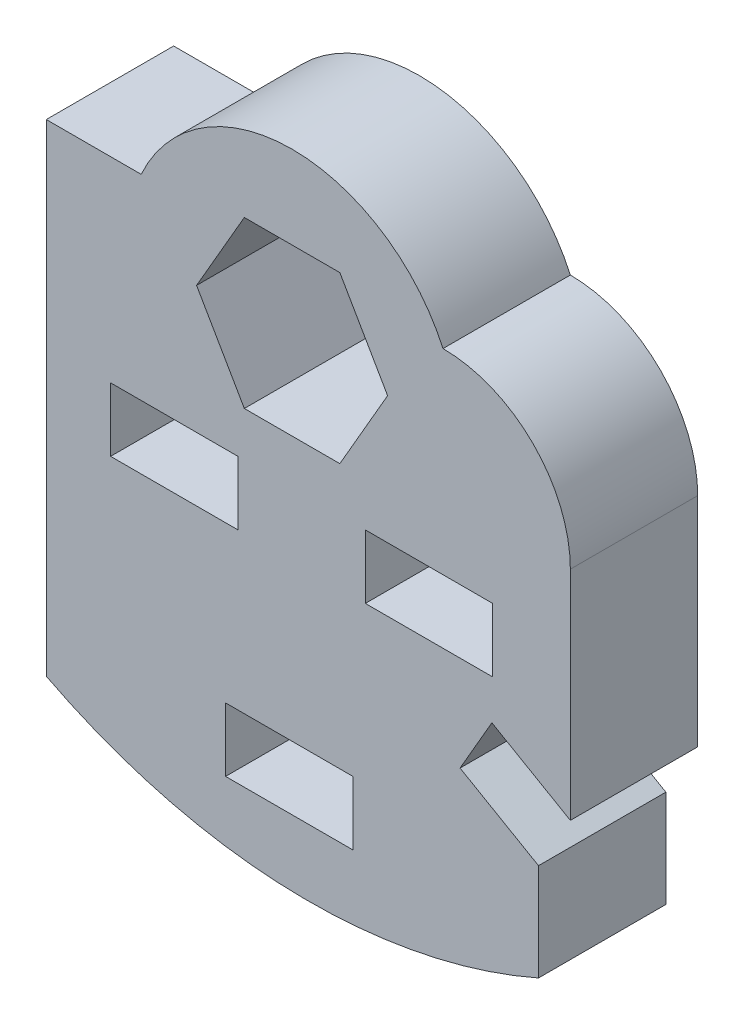
ISO-10303-21;
HEADER;
FILE_DESCRIPTION(('STEP AP214'),'2;1');
FILE_NAME('part.step','',(''),(''),'','','');
FILE_SCHEMA(('AUTOMOTIVE_DESIGN { 1 0 10303 214 1 1 1 1 }'));
ENDSEC;
DATA;
#1=APPLICATION_CONTEXT('core data for automotive mechanical design processes');
#2=APPLICATION_PROTOCOL_DEFINITION('international standard','automotive_design',2000,#1);
#3=PRODUCT_CONTEXT('',#1,'mechanical');
#4=PRODUCT('Part','Part','',(#3));
#5=PRODUCT_RELATED_PRODUCT_CATEGORY('part','',(#4));
#6=PRODUCT_DEFINITION_FORMATION('','',#4);
#7=PRODUCT_DEFINITION_CONTEXT('part definition',#1,'design');
#8=PRODUCT_DEFINITION('design','',#6,#7);
#9=PRODUCT_DEFINITION_SHAPE('','',#8);
#10=(LENGTH_UNIT() NAMED_UNIT(*) SI_UNIT(.MILLI.,.METRE.));
#11=(NAMED_UNIT(*) PLANE_ANGLE_UNIT() SI_UNIT($,.RADIAN.));
#12=(NAMED_UNIT(*) SI_UNIT($,.STERADIAN.) SOLID_ANGLE_UNIT());
#13=UNCERTAINTY_MEASURE_WITH_UNIT(LENGTH_MEASURE(1.E-05),#10,'distance_accuracy_value','');
#14=(GEOMETRIC_REPRESENTATION_CONTEXT(3) GLOBAL_UNCERTAINTY_ASSIGNED_CONTEXT((#13)) GLOBAL_UNIT_ASSIGNED_CONTEXT((#10,
#11,#12)) REPRESENTATION_CONTEXT('',''));
#15=CARTESIAN_POINT('',(0.,0.,0.));
#16=DIRECTION('',(0.,0.,1.));
#17=DIRECTION('',(1.,0.,0.));
#18=AXIS2_PLACEMENT_3D('',#15,#16,#17);
#19=CARTESIAN_POINT('',(13.9396736813884,13.1425512647541,4.));
#20=DIRECTION('',(0.,0.,1.));
#21=DIRECTION('',(1.,0.,0.));
#22=AXIS2_PLACEMENT_3D('',#19,#20,#21);
#23=PLANE('',#22);
#24=DIRECTION('',(0.,-1.,0.));
#25=VECTOR('',#24,1.);
#26=CARTESIAN_POINT('',(11.5,8.99107807997269,4.));
#27=LINE('',#26,#25);
#28=CARTESIAN_POINT('',(11.5,10.9910780799727,4.));
#29=VERTEX_POINT('',#28);
#30=CARTESIAN_POINT('',(11.5,8.99107807997269,4.));
#31=VERTEX_POINT('',#30);
#32=EDGE_CURVE('E270',#29,#31,#27,.T.);
#33=ORIENTED_EDGE('',*,*,#32,.F.);
#34=DIRECTION('',(-1.,0.,0.));
#35=VECTOR('',#34,1.);
#36=CARTESIAN_POINT('',(11.5,10.9910780799727,4.));
#37=LINE('',#36,#35);
#38=CARTESIAN_POINT('',(15.5,10.9910780799727,4.));
#39=VERTEX_POINT('',#38);
#40=EDGE_CURVE('E268',#39,#29,#37,.T.);
#41=ORIENTED_EDGE('',*,*,#40,.F.);
#42=DIRECTION('',(0.,1.,0.));
#43=VECTOR('',#42,1.);
#44=CARTESIAN_POINT('',(15.5,8.99107807997269,4.));
#45=LINE('',#44,#43);
#46=CARTESIAN_POINT('',(15.5,8.99107807997269,4.));
#47=VERTEX_POINT('',#46);
#48=EDGE_CURVE('E276',#47,#39,#45,.T.);
#49=ORIENTED_EDGE('',*,*,#48,.F.);
#50=DIRECTION('',(1.,0.,0.));
#51=VECTOR('',#50,1.);
#52=CARTESIAN_POINT('',(11.5,8.99107807997269,4.));
#53=LINE('',#52,#51);
#54=EDGE_CURVE('E273',#31,#47,#53,.T.);
#55=ORIENTED_EDGE('',*,*,#54,.F.);
#56=EDGE_LOOP('',(#33,#41,#49,#55));
#57=FACE_BOUND('',#56,.T.);
#58=DIRECTION('',(0.,-1.,0.));
#59=VECTOR('',#58,1.);
#60=CARTESIAN_POINT('',(7.11105611722977,2.0910780799727,4.));
#61=LINE('',#60,#59);
#62=CARTESIAN_POINT('',(7.11105611722977,4.0910780799727,4.));
#63=VERTEX_POINT('',#62);
#64=CARTESIAN_POINT('',(7.11105611722977,2.0910780799727,4.));
#65=VERTEX_POINT('',#64);
#66=EDGE_CURVE('E332',#63,#65,#61,.T.);
#67=ORIENTED_EDGE('',*,*,#66,.F.);
#68=DIRECTION('',(-1.,0.,0.));
#69=VECTOR('',#68,1.);
#70=CARTESIAN_POINT('',(7.11105611722977,4.0910780799727,4.));
#71=LINE('',#70,#69);
#72=CARTESIAN_POINT('',(11.1110561172298,4.0910780799727,4.));
#73=VERTEX_POINT('',#72);
#74=EDGE_CURVE('E330',#73,#63,#71,.T.);
#75=ORIENTED_EDGE('',*,*,#74,.F.);
#76=DIRECTION('',(0.,1.,0.));
#77=VECTOR('',#76,1.);
#78=CARTESIAN_POINT('',(11.1110561172298,2.0910780799727,4.));
#79=LINE('',#78,#77);
#80=CARTESIAN_POINT('',(11.1110561172298,2.0910780799727,4.));
#81=VERTEX_POINT('',#80);
#82=EDGE_CURVE('E338',#81,#73,#79,.T.);
#83=ORIENTED_EDGE('',*,*,#82,.F.);
#84=DIRECTION('',(1.,0.,0.));
#85=VECTOR('',#84,1.);
#86=CARTESIAN_POINT('',(7.11105611722977,2.0910780799727,4.));
#87=LINE('',#86,#85);
#88=EDGE_CURVE('E335',#65,#81,#87,.T.);
#89=ORIENTED_EDGE('',*,*,#88,.F.);
#90=EDGE_LOOP('',(#67,#75,#83,#89));
#91=FACE_BOUND('',#90,.T.);
#92=CARTESIAN_POINT('',(13.9396736813884,13.1425512647541,4.));
#93=DIRECTION('',(0.,0.,1.));
#94=DIRECTION('',(1.,0.,0.));
#95=AXIS2_PLACEMENT_3D('',#92,#93,#94);
#96=CIRCLE('',#95,4.);
#97=CARTESIAN_POINT('',(17.9396736813884,13.142551264754,4.));
#98=VERTEX_POINT('',#97);
#99=CARTESIAN_POINT('',(13.9396736813883,17.1425512647541,4.));
#100=VERTEX_POINT('',#99);
#101=EDGE_CURVE('E361',#98,#100,#96,.T.);
#102=ORIENTED_EDGE('',*,*,#101,.T.);
#103=CARTESIAN_POINT('',(9.20000000000002,14.992551264754,4.));
#104=DIRECTION('',(0.,0.,1.));
#105=DIRECTION('',(1.,0.,0.));
#106=AXIS2_PLACEMENT_3D('',#103,#104,#105);
#107=CIRCLE('',#106,5.20451790332642);
#108=CARTESIAN_POINT('',(4.46032631861171,17.1425512647541,4.));
#109=VERTEX_POINT('',#108);
#110=EDGE_CURVE('E364',#100,#109,#107,.T.);
#111=ORIENTED_EDGE('',*,*,#110,.T.);
#112=DIRECTION('',(-1.,0.,0.));
#113=VECTOR('',#112,1.);
#114=CARTESIAN_POINT('',(4.46032631861171,17.1425512647541,4.));
#115=LINE('',#114,#113);
#116=CARTESIAN_POINT('',(1.48,17.1425512647541,4.));
#117=VERTEX_POINT('',#116);
#118=EDGE_CURVE('E367',#109,#117,#115,.T.);
#119=ORIENTED_EDGE('',*,*,#118,.T.);
#120=DIRECTION('',(0.,-1.,0.));
#121=VECTOR('',#120,1.);
#122=CARTESIAN_POINT('',(1.48,17.1425512647541,4.));
#123=LINE('',#122,#121);
#124=CARTESIAN_POINT('',(1.47999999999999,2.,4.));
#125=VERTEX_POINT('',#124);
#126=EDGE_CURVE('E369',#117,#125,#123,.T.);
#127=ORIENTED_EDGE('',*,*,#126,.T.);
#128=CARTESIAN_POINT('',(9.70983684069418,17.9325536061118,4.));
#129=DIRECTION('',(0.,0.,1.));
#130=DIRECTION('',(1.,0.,0.));
#131=AXIS2_PLACEMENT_3D('',#128,#129,#130);
#132=CIRCLE('',#131,17.9325536061118);
#133=CARTESIAN_POINT('',(16.9396736813884,1.52201010222338,4.));
#134=VERTEX_POINT('',#133);
#135=EDGE_CURVE('E371',#125,#134,#132,.T.);
#136=ORIENTED_EDGE('',*,*,#135,.T.);
#137=DIRECTION('',(0.,1.,0.));
#138=VECTOR('',#137,1.);
#139=CARTESIAN_POINT('',(16.9396736813884,4.57735026918963,4.));
#140=LINE('',#139,#138);
#141=CARTESIAN_POINT('',(16.9396736813884,4.57735026918963,4.));
#142=VERTEX_POINT('',#141);
#143=EDGE_CURVE('E373',#134,#142,#140,.T.);
#144=ORIENTED_EDGE('',*,*,#143,.T.);
#145=DIRECTION('',(-0.866025403784438,0.5,0.));
#146=VECTOR('',#145,1.);
#147=CARTESIAN_POINT('',(14.4755720662506,6.,4.));
#148=LINE('',#147,#146);
#149=CARTESIAN_POINT('',(14.4755720662506,6.,4.));
#150=VERTEX_POINT('',#149);
#151=EDGE_CURVE('E375',#142,#150,#148,.T.);
#152=ORIENTED_EDGE('',*,*,#151,.T.);
#153=DIRECTION('',(0.500000000000005,0.866025403784436,0.));
#154=VECTOR('',#153,1.);
#155=CARTESIAN_POINT('',(14.4755720662506,6.,4.));
#156=LINE('',#155,#154);
#157=CARTESIAN_POINT('',(15.4755720662506,7.73205080756889,4.));
#158=VERTEX_POINT('',#157);
#159=EDGE_CURVE('E377',#150,#158,#156,.T.);
#160=ORIENTED_EDGE('',*,*,#159,.T.);
#161=DIRECTION('',(0.866025403784436,-0.500000000000005,0.));
#162=VECTOR('',#161,1.);
#163=CARTESIAN_POINT('',(15.4755720662506,7.73205080756889,4.));
#164=LINE('',#163,#162);
#165=CARTESIAN_POINT('',(17.9396736813884,6.30940107675851,4.));
#166=VERTEX_POINT('',#165);
#167=EDGE_CURVE('E379',#158,#166,#164,.T.);
#168=ORIENTED_EDGE('',*,*,#167,.T.);
#169=DIRECTION('',(0.,1.,0.));
#170=VECTOR('',#169,1.);
#171=CARTESIAN_POINT('',(17.9396736813884,13.142551264754,4.));
#172=LINE('',#171,#170);
#173=EDGE_CURVE('E381',#166,#98,#172,.T.);
#174=ORIENTED_EDGE('',*,*,#173,.T.);
#175=EDGE_LOOP('',(#102,#111,#119,#127,#136,#144,#152,#160,#168,#174));
#176=FACE_BOUND('',#175,.T.);
#177=DIRECTION('',(0.,-1.,0.));
#178=VECTOR('',#177,1.);
#179=CARTESIAN_POINT('',(3.5,8.99107807997269,4.));
#180=LINE('',#179,#178);
#181=CARTESIAN_POINT('',(3.5,10.9910780799727,4.));
#182=VERTEX_POINT('',#181);
#183=CARTESIAN_POINT('',(3.5,8.99107807997269,4.));
#184=VERTEX_POINT('',#183);
#185=EDGE_CURVE('E301',#182,#184,#180,.T.);
#186=ORIENTED_EDGE('',*,*,#185,.F.);
#187=DIRECTION('',(-1.,0.,0.));
#188=VECTOR('',#187,1.);
#189=CARTESIAN_POINT('',(3.5,10.9910780799727,4.));
#190=LINE('',#189,#188);
#191=CARTESIAN_POINT('',(7.5,10.9910780799727,4.));
#192=VERTEX_POINT('',#191);
#193=EDGE_CURVE('E299',#192,#182,#190,.T.);
#194=ORIENTED_EDGE('',*,*,#193,.F.);
#195=DIRECTION('',(0.,1.,0.));
#196=VECTOR('',#195,1.);
#197=CARTESIAN_POINT('',(7.5,8.99107807997269,4.));
#198=LINE('',#197,#196);
#199=CARTESIAN_POINT('',(7.5,8.99107807997269,4.));
#200=VERTEX_POINT('',#199);
#201=EDGE_CURVE('E307',#200,#192,#198,.T.);
#202=ORIENTED_EDGE('',*,*,#201,.F.);
#203=DIRECTION('',(1.,0.,0.));
#204=VECTOR('',#203,1.);
#205=CARTESIAN_POINT('',(3.5,8.99107807997269,4.));
#206=LINE('',#205,#204);
#207=EDGE_CURVE('E304',#184,#200,#206,.T.);
#208=ORIENTED_EDGE('',*,*,#207,.F.);
#209=EDGE_LOOP('',(#186,#194,#202,#208));
#210=FACE_BOUND('',#209,.T.);
#211=DIRECTION('',(0.500000000000001,-0.866025403784438,0.));
#212=VECTOR('',#211,1.);
#213=CARTESIAN_POINT('',(6.20000000000001,14.9910780799727,4.));
#214=LINE('',#213,#212);
#215=CARTESIAN_POINT('',(6.20000000000001,14.9910780799727,4.));
#216=VERTEX_POINT('',#215);
#217=CARTESIAN_POINT('',(7.70000000000002,12.3930018686194,4.));
#218=VERTEX_POINT('',#217);
#219=EDGE_CURVE('E225',#216,#218,#214,.T.);
#220=ORIENTED_EDGE('',*,*,#219,.F.);
#221=DIRECTION('',(-0.499999999999995,-0.866025403784442,0.));
#222=VECTOR('',#221,1.);
#223=CARTESIAN_POINT('',(7.69999999999998,17.589154291326,4.));
#224=LINE('',#223,#222);
#225=CARTESIAN_POINT('',(7.69999999999998,17.589154291326,4.));
#226=VERTEX_POINT('',#225);
#227=EDGE_CURVE('E217',#226,#216,#224,.T.);
#228=ORIENTED_EDGE('',*,*,#227,.F.);
#229=DIRECTION('',(-1.,0.,0.));
#230=VECTOR('',#229,1.);
#231=CARTESIAN_POINT('',(10.7,17.589154291326,4.));
#232=LINE('',#231,#230);
#233=CARTESIAN_POINT('',(10.7,17.589154291326,4.));
#234=VERTEX_POINT('',#233);
#235=EDGE_CURVE('E246',#234,#226,#232,.T.);
#236=ORIENTED_EDGE('',*,*,#235,.F.);
#237=DIRECTION('',(-0.500000000000007,0.866025403784435,0.));
#238=VECTOR('',#237,1.);
#239=CARTESIAN_POINT('',(12.2,14.9910780799727,4.));
#240=LINE('',#239,#238);
#241=CARTESIAN_POINT('',(12.2,14.9910780799727,4.));
#242=VERTEX_POINT('',#241);
#243=EDGE_CURVE('E244',#242,#234,#240,.T.);
#244=ORIENTED_EDGE('',*,*,#243,.F.);
#245=DIRECTION('',(0.499999999999995,0.866025403784442,0.));
#246=VECTOR('',#245,1.);
#247=CARTESIAN_POINT('',(10.7,12.3930018686194,4.));
#248=LINE('',#247,#246);
#249=CARTESIAN_POINT('',(10.7,12.3930018686194,4.));
#250=VERTEX_POINT('',#249);
#251=EDGE_CURVE('E240',#250,#242,#248,.T.);
#252=ORIENTED_EDGE('',*,*,#251,.F.);
#253=DIRECTION('',(1.,0.,0.));
#254=VECTOR('',#253,1.);
#255=CARTESIAN_POINT('',(7.70000000000002,12.3930018686194,4.));
#256=LINE('',#255,#254);
#257=EDGE_CURVE('E238',#218,#250,#256,.T.);
#258=ORIENTED_EDGE('',*,*,#257,.F.);
#259=EDGE_LOOP('',(#220,#228,#236,#244,#252,#258));
#260=FACE_BOUND('',#259,.T.);
#261=ADVANCED_FACE('F32',(#57,#91,#176,#210,#260),#23,.T.);
#262=CARTESIAN_POINT('',(13.9396736813884,13.1425512647541,0.));
#263=DIRECTION('',(0.,0.,1.));
#264=DIRECTION('',(1.,0.,0.));
#265=AXIS2_PLACEMENT_3D('',#262,#263,#264);
#266=PLANE('',#265);
#267=DIRECTION('',(-1.,0.,0.));
#268=VECTOR('',#267,1.);
#269=CARTESIAN_POINT('',(11.5,10.9910780799727,0.));
#270=LINE('',#269,#268);
#271=CARTESIAN_POINT('',(15.5,10.9910780799727,0.));
#272=VERTEX_POINT('',#271);
#273=CARTESIAN_POINT('',(11.5,10.9910780799727,0.));
#274=VERTEX_POINT('',#273);
#275=EDGE_CURVE('E233',#272,#274,#270,.T.);
#276=ORIENTED_EDGE('',*,*,#275,.T.);
#277=DIRECTION('',(0.,-1.,0.));
#278=VECTOR('',#277,1.);
#279=CARTESIAN_POINT('',(11.5,8.99107807997269,0.));
#280=LINE('',#279,#278);
#281=CARTESIAN_POINT('',(11.5,8.99107807997269,0.));
#282=VERTEX_POINT('',#281);
#283=EDGE_CURVE('E281',#274,#282,#280,.T.);
#284=ORIENTED_EDGE('',*,*,#283,.T.);
#285=DIRECTION('',(1.,0.,0.));
#286=VECTOR('',#285,1.);
#287=CARTESIAN_POINT('',(11.5,8.99107807997269,0.));
#288=LINE('',#287,#286);
#289=CARTESIAN_POINT('',(15.5,8.99107807997269,0.));
#290=VERTEX_POINT('',#289);
#291=EDGE_CURVE('E284',#282,#290,#288,.T.);
#292=ORIENTED_EDGE('',*,*,#291,.T.);
#293=DIRECTION('',(0.,1.,0.));
#294=VECTOR('',#293,1.);
#295=CARTESIAN_POINT('',(15.5,8.99107807997269,0.));
#296=LINE('',#295,#294);
#297=EDGE_CURVE('E271',#290,#272,#296,.T.);
#298=ORIENTED_EDGE('',*,*,#297,.T.);
#299=EDGE_LOOP('',(#276,#284,#292,#298));
#300=FACE_BOUND('',#299,.T.);
#301=DIRECTION('',(-1.,0.,0.));
#302=VECTOR('',#301,1.);
#303=CARTESIAN_POINT('',(7.11105611722977,4.0910780799727,0.));
#304=LINE('',#303,#302);
#305=CARTESIAN_POINT('',(11.1110561172298,4.0910780799727,0.));
#306=VERTEX_POINT('',#305);
#307=CARTESIAN_POINT('',(7.11105611722977,4.0910780799727,0.));
#308=VERTEX_POINT('',#307);
#309=EDGE_CURVE('E329',#306,#308,#304,.T.);
#310=ORIENTED_EDGE('',*,*,#309,.T.);
#311=DIRECTION('',(0.,-1.,0.));
#312=VECTOR('',#311,1.);
#313=CARTESIAN_POINT('',(7.11105611722977,2.0910780799727,0.));
#314=LINE('',#313,#312);
#315=CARTESIAN_POINT('',(7.11105611722977,2.0910780799727,0.));
#316=VERTEX_POINT('',#315);
#317=EDGE_CURVE('E343',#308,#316,#314,.T.);
#318=ORIENTED_EDGE('',*,*,#317,.T.);
#319=DIRECTION('',(1.,0.,0.));
#320=VECTOR('',#319,1.);
#321=CARTESIAN_POINT('',(7.11105611722977,2.0910780799727,0.));
#322=LINE('',#321,#320);
#323=CARTESIAN_POINT('',(11.1110561172298,2.0910780799727,0.));
#324=VERTEX_POINT('',#323);
#325=EDGE_CURVE('E346',#316,#324,#322,.T.);
#326=ORIENTED_EDGE('',*,*,#325,.T.);
#327=DIRECTION('',(0.,1.,0.));
#328=VECTOR('',#327,1.);
#329=CARTESIAN_POINT('',(11.1110561172298,2.0910780799727,0.));
#330=LINE('',#329,#328);
#331=EDGE_CURVE('E333',#324,#306,#330,.T.);
#332=ORIENTED_EDGE('',*,*,#331,.T.);
#333=EDGE_LOOP('',(#310,#318,#326,#332));
#334=FACE_BOUND('',#333,.T.);
#335=CARTESIAN_POINT('',(13.9396736813884,13.1425512647541,0.));
#336=DIRECTION('',(0.,0.,1.));
#337=DIRECTION('',(1.,0.,0.));
#338=AXIS2_PLACEMENT_3D('',#335,#336,#337);
#339=CIRCLE('',#338,4.);
#340=CARTESIAN_POINT('',(17.9396736813884,13.142551264754,0.));
#341=VERTEX_POINT('',#340);
#342=CARTESIAN_POINT('',(13.9396736813883,17.1425512647541,0.));
#343=VERTEX_POINT('',#342);
#344=EDGE_CURVE('E360',#341,#343,#339,.T.);
#345=ORIENTED_EDGE('',*,*,#344,.F.);
#346=DIRECTION('',(0.,1.,0.));
#347=VECTOR('',#346,1.);
#348=CARTESIAN_POINT('',(17.9396736813884,13.142551264754,0.));
#349=LINE('',#348,#347);
#350=CARTESIAN_POINT('',(17.9396736813884,6.30940107675851,0.));
#351=VERTEX_POINT('',#350);
#352=EDGE_CURVE('E365',#351,#341,#349,.T.);
#353=ORIENTED_EDGE('',*,*,#352,.F.);
#354=DIRECTION('',(0.866025403784436,-0.500000000000005,0.));
#355=VECTOR('',#354,1.);
#356=CARTESIAN_POINT('',(15.4755720662506,7.73205080756889,0.));
#357=LINE('',#356,#355);
#358=CARTESIAN_POINT('',(15.4755720662506,7.73205080756889,0.));
#359=VERTEX_POINT('',#358);
#360=EDGE_CURVE('E400',#359,#351,#357,.T.);
#361=ORIENTED_EDGE('',*,*,#360,.F.);
#362=DIRECTION('',(0.500000000000005,0.866025403784436,0.));
#363=VECTOR('',#362,1.);
#364=CARTESIAN_POINT('',(14.4755720662506,6.,0.));
#365=LINE('',#364,#363);
#366=CARTESIAN_POINT('',(14.4755720662506,6.,0.));
#367=VERTEX_POINT('',#366);
#368=EDGE_CURVE('E398',#367,#359,#365,.T.);
#369=ORIENTED_EDGE('',*,*,#368,.F.);
#370=DIRECTION('',(-0.866025403784438,0.5,0.));
#371=VECTOR('',#370,1.);
#372=CARTESIAN_POINT('',(14.4755720662506,6.,0.));
#373=LINE('',#372,#371);
#374=CARTESIAN_POINT('',(16.9396736813884,4.57735026918963,0.));
#375=VERTEX_POINT('',#374);
#376=EDGE_CURVE('E396',#375,#367,#373,.T.);
#377=ORIENTED_EDGE('',*,*,#376,.F.);
#378=DIRECTION('',(0.,1.,0.));
#379=VECTOR('',#378,1.);
#380=CARTESIAN_POINT('',(16.9396736813884,4.57735026918963,0.));
#381=LINE('',#380,#379);
#382=CARTESIAN_POINT('',(16.9396736813884,1.52201010222338,0.));
#383=VERTEX_POINT('',#382);
#384=EDGE_CURVE('E394',#383,#375,#381,.T.);
#385=ORIENTED_EDGE('',*,*,#384,.F.);
#386=CARTESIAN_POINT('',(9.70983684069418,17.9325536061118,0.));
#387=DIRECTION('',(0.,0.,1.));
#388=DIRECTION('',(1.,0.,0.));
#389=AXIS2_PLACEMENT_3D('',#386,#387,#388);
#390=CIRCLE('',#389,17.9325536061118);
#391=CARTESIAN_POINT('',(1.47999999999999,2.,0.));
#392=VERTEX_POINT('',#391);
#393=EDGE_CURVE('E392',#392,#383,#390,.T.);
#394=ORIENTED_EDGE('',*,*,#393,.F.);
#395=DIRECTION('',(0.,-1.,0.));
#396=VECTOR('',#395,1.);
#397=CARTESIAN_POINT('',(1.48,17.1425512647541,0.));
#398=LINE('',#397,#396);
#399=CARTESIAN_POINT('',(1.48,17.1425512647541,0.));
#400=VERTEX_POINT('',#399);
#401=EDGE_CURVE('E390',#400,#392,#398,.T.);
#402=ORIENTED_EDGE('',*,*,#401,.F.);
#403=DIRECTION('',(-1.,0.,0.));
#404=VECTOR('',#403,1.);
#405=CARTESIAN_POINT('',(4.46032631861171,17.1425512647541,0.));
#406=LINE('',#405,#404);
#407=CARTESIAN_POINT('',(4.46032631861171,17.1425512647541,0.));
#408=VERTEX_POINT('',#407);
#409=EDGE_CURVE('E388',#408,#400,#406,.T.);
#410=ORIENTED_EDGE('',*,*,#409,.F.);
#411=CARTESIAN_POINT('',(9.20000000000002,14.992551264754,0.));
#412=DIRECTION('',(0.,0.,1.));
#413=DIRECTION('',(1.,0.,0.));
#414=AXIS2_PLACEMENT_3D('',#411,#412,#413);
#415=CIRCLE('',#414,5.20451790332642);
#416=EDGE_CURVE('E386',#343,#408,#415,.T.);
#417=ORIENTED_EDGE('',*,*,#416,.F.);
#418=EDGE_LOOP('',(#345,#353,#361,#369,#377,#385,#394,#402,#410,#417));
#419=FACE_BOUND('',#418,.T.);
#420=DIRECTION('',(-1.,0.,0.));
#421=VECTOR('',#420,1.);
#422=CARTESIAN_POINT('',(3.5,10.9910780799727,0.));
#423=LINE('',#422,#421);
#424=CARTESIAN_POINT('',(7.5,10.9910780799727,0.));
#425=VERTEX_POINT('',#424);
#426=CARTESIAN_POINT('',(3.5,10.9910780799727,0.));
#427=VERTEX_POINT('',#426);
#428=EDGE_CURVE('E298',#425,#427,#423,.T.);
#429=ORIENTED_EDGE('',*,*,#428,.T.);
#430=DIRECTION('',(0.,-1.,0.));
#431=VECTOR('',#430,1.);
#432=CARTESIAN_POINT('',(3.5,8.99107807997269,0.));
#433=LINE('',#432,#431);
#434=CARTESIAN_POINT('',(3.5,8.99107807997269,0.));
#435=VERTEX_POINT('',#434);
#436=EDGE_CURVE('E312',#427,#435,#433,.T.);
#437=ORIENTED_EDGE('',*,*,#436,.T.);
#438=DIRECTION('',(1.,0.,0.));
#439=VECTOR('',#438,1.);
#440=CARTESIAN_POINT('',(3.5,8.99107807997269,0.));
#441=LINE('',#440,#439);
#442=CARTESIAN_POINT('',(7.5,8.99107807997269,0.));
#443=VERTEX_POINT('',#442);
#444=EDGE_CURVE('E315',#435,#443,#441,.T.);
#445=ORIENTED_EDGE('',*,*,#444,.T.);
#446=DIRECTION('',(0.,1.,0.));
#447=VECTOR('',#446,1.);
#448=CARTESIAN_POINT('',(7.5,8.99107807997269,0.));
#449=LINE('',#448,#447);
#450=EDGE_CURVE('E302',#443,#425,#449,.T.);
#451=ORIENTED_EDGE('',*,*,#450,.T.);
#452=EDGE_LOOP('',(#429,#437,#445,#451));
#453=FACE_BOUND('',#452,.T.);
#454=DIRECTION('',(-0.499999999999995,-0.866025403784442,0.));
#455=VECTOR('',#454,1.);
#456=CARTESIAN_POINT('',(7.69999999999998,17.589154291326,0.));
#457=LINE('',#456,#455);
#458=CARTESIAN_POINT('',(7.69999999999998,17.589154291326,0.));
#459=VERTEX_POINT('',#458);
#460=CARTESIAN_POINT('',(6.20000000000001,14.9910780799727,0.));
#461=VERTEX_POINT('',#460);
#462=EDGE_CURVE('E55',#459,#461,#457,.T.);
#463=ORIENTED_EDGE('',*,*,#462,.T.);
#464=DIRECTION('',(0.500000000000001,-0.866025403784438,0.));
#465=VECTOR('',#464,1.);
#466=CARTESIAN_POINT('',(6.20000000000001,14.9910780799727,0.));
#467=LINE('',#466,#465);
#468=CARTESIAN_POINT('',(7.70000000000002,12.3930018686194,0.));
#469=VERTEX_POINT('',#468);
#470=EDGE_CURVE('E232',#461,#469,#467,.T.);
#471=ORIENTED_EDGE('',*,*,#470,.T.);
#472=DIRECTION('',(1.,0.,0.));
#473=VECTOR('',#472,1.);
#474=CARTESIAN_POINT('',(7.70000000000002,12.3930018686194,0.));
#475=LINE('',#474,#473);
#476=CARTESIAN_POINT('',(10.7,12.3930018686194,0.));
#477=VERTEX_POINT('',#476);
#478=EDGE_CURVE('E250',#469,#477,#475,.T.);
#479=ORIENTED_EDGE('',*,*,#478,.T.);
#480=DIRECTION('',(0.499999999999995,0.866025403784442,0.));
#481=VECTOR('',#480,1.);
#482=CARTESIAN_POINT('',(10.7,12.3930018686194,0.));
#483=LINE('',#482,#481);
#484=CARTESIAN_POINT('',(12.2,14.9910780799727,0.));
#485=VERTEX_POINT('',#484);
#486=EDGE_CURVE('E253',#477,#485,#483,.T.);
#487=ORIENTED_EDGE('',*,*,#486,.T.);
#488=DIRECTION('',(-0.500000000000007,0.866025403784435,0.));
#489=VECTOR('',#488,1.);
#490=CARTESIAN_POINT('',(12.2,14.9910780799727,0.));
#491=LINE('',#490,#489);
#492=CARTESIAN_POINT('',(10.7,17.589154291326,0.));
#493=VERTEX_POINT('',#492);
#494=EDGE_CURVE('E256',#485,#493,#491,.T.);
#495=ORIENTED_EDGE('',*,*,#494,.T.);
#496=DIRECTION('',(-1.,0.,0.));
#497=VECTOR('',#496,1.);
#498=CARTESIAN_POINT('',(10.7,17.589154291326,0.));
#499=LINE('',#498,#497);
#500=EDGE_CURVE('E226',#493,#459,#499,.T.);
#501=ORIENTED_EDGE('',*,*,#500,.T.);
#502=EDGE_LOOP('',(#463,#471,#479,#487,#495,#501));
#503=FACE_BOUND('',#502,.T.);
#504=ADVANCED_FACE('F436',(#300,#334,#419,#453,#503),#266,.F.);
#505=CARTESIAN_POINT('',(13.9396736813884,13.1425512647541,4.));
#506=DIRECTION('',(0.,0.,-1.));
#507=DIRECTION('',(-1.,0.,0.));
#508=AXIS2_PLACEMENT_3D('',#505,#506,#507);
#509=CYLINDRICAL_SURFACE('',#508,4.);
#510=ORIENTED_EDGE('',*,*,#344,.T.);
#511=DIRECTION('',(0.,0.,-1.));
#512=VECTOR('',#511,1.);
#513=CARTESIAN_POINT('',(13.9396736813883,17.1425512647541,4.));
#514=LINE('',#513,#512);
#515=EDGE_CURVE('E11',#100,#343,#514,.T.);
#516=ORIENTED_EDGE('',*,*,#515,.F.);
#517=ORIENTED_EDGE('',*,*,#101,.F.);
#518=DIRECTION('',(0.,0.,-1.));
#519=VECTOR('',#518,1.);
#520=CARTESIAN_POINT('',(17.9396736813884,13.142551264754,4.));
#521=LINE('',#520,#519);
#522=EDGE_CURVE('E383',#98,#341,#521,.T.);
#523=ORIENTED_EDGE('',*,*,#522,.T.);
#524=EDGE_LOOP('',(#510,#516,#517,#523));
#525=FACE_BOUND('',#524,.T.);
#526=ADVANCED_FACE('F34',(#525),#509,.T.);
#527=CARTESIAN_POINT('',(9.20000000000002,14.992551264754,4.));
#528=DIRECTION('',(0.,0.,-1.));
#529=DIRECTION('',(-1.,0.,0.));
#530=AXIS2_PLACEMENT_3D('',#527,#528,#529);
#531=CYLINDRICAL_SURFACE('',#530,5.20451790332642);
#532=ORIENTED_EDGE('',*,*,#416,.T.);
#533=DIRECTION('',(0.,0.,-1.));
#534=VECTOR('',#533,1.);
#535=CARTESIAN_POINT('',(4.46032631861171,17.1425512647541,4.));
#536=LINE('',#535,#534);
#537=EDGE_CURVE('E40',#109,#408,#536,.T.);
#538=ORIENTED_EDGE('',*,*,#537,.F.);
#539=ORIENTED_EDGE('',*,*,#110,.F.);
#540=ORIENTED_EDGE('',*,*,#515,.T.);
#541=EDGE_LOOP('',(#532,#538,#539,#540));
#542=FACE_BOUND('',#541,.T.);
#543=ADVANCED_FACE('F454',(#542),#531,.T.);
#544=CARTESIAN_POINT('',(4.46032631861171,17.1425512647541,4.));
#545=DIRECTION('',(0.,-1.,0.));
#546=DIRECTION('',(0.,0.,-1.));
#547=AXIS2_PLACEMENT_3D('',#544,#545,#546);
#548=PLANE('',#547);
#549=ORIENTED_EDGE('',*,*,#409,.T.);
#550=DIRECTION('',(0.,0.,-1.));
#551=VECTOR('',#550,1.);
#552=CARTESIAN_POINT('',(1.48,17.1425512647541,4.));
#553=LINE('',#552,#551);
#554=EDGE_CURVE('E423',#117,#400,#553,.T.);
#555=ORIENTED_EDGE('',*,*,#554,.F.);
#556=ORIENTED_EDGE('',*,*,#118,.F.);
#557=ORIENTED_EDGE('',*,*,#537,.T.);
#558=EDGE_LOOP('',(#549,#555,#556,#557));
#559=FACE_BOUND('',#558,.T.);
#560=ADVANCED_FACE('F430',(#559),#548,.F.);
#561=CARTESIAN_POINT('',(1.48,17.1425512647541,4.));
#562=DIRECTION('',(1.,0.,0.));
#563=DIRECTION('',(0.,1.,0.));
#564=AXIS2_PLACEMENT_3D('',#561,#562,#563);
#565=PLANE('',#564);
#566=ORIENTED_EDGE('',*,*,#401,.T.);
#567=DIRECTION('',(0.,0.,-1.));
#568=VECTOR('',#567,1.);
#569=CARTESIAN_POINT('',(1.47999999999999,2.,4.));
#570=LINE('',#569,#568);
#571=EDGE_CURVE('E420',#125,#392,#570,.T.);
#572=ORIENTED_EDGE('',*,*,#571,.F.);
#573=ORIENTED_EDGE('',*,*,#126,.F.);
#574=ORIENTED_EDGE('',*,*,#554,.T.);
#575=EDGE_LOOP('',(#566,#572,#573,#574));
#576=FACE_BOUND('',#575,.T.);
#577=ADVANCED_FACE('F442',(#576),#565,.F.);
#578=CARTESIAN_POINT('',(9.70983684069418,17.9325536061118,4.));
#579=DIRECTION('',(0.,0.,-1.));
#580=DIRECTION('',(-1.,0.,0.));
#581=AXIS2_PLACEMENT_3D('',#578,#579,#580);
#582=CYLINDRICAL_SURFACE('',#581,17.9325536061118);
#583=ORIENTED_EDGE('',*,*,#393,.T.);
#584=DIRECTION('',(0.,0.,-1.));
#585=VECTOR('',#584,1.);
#586=CARTESIAN_POINT('',(16.9396736813884,1.52201010222338,4.));
#587=LINE('',#586,#585);
#588=EDGE_CURVE('E417',#134,#383,#587,.T.);
#589=ORIENTED_EDGE('',*,*,#588,.F.);
#590=ORIENTED_EDGE('',*,*,#135,.F.);
#591=ORIENTED_EDGE('',*,*,#571,.T.);
#592=EDGE_LOOP('',(#583,#589,#590,#591));
#593=FACE_BOUND('',#592,.T.);
#594=ADVANCED_FACE('F446',(#593),#582,.T.);
#595=CARTESIAN_POINT('',(16.9396736813884,4.57735026918963,4.));
#596=DIRECTION('',(-1.,0.,0.));
#597=DIRECTION('',(0.,0.,1.));
#598=AXIS2_PLACEMENT_3D('',#595,#596,#597);
#599=PLANE('',#598);
#600=ORIENTED_EDGE('',*,*,#384,.T.);
#601=DIRECTION('',(0.,0.,-1.));
#602=VECTOR('',#601,1.);
#603=CARTESIAN_POINT('',(16.9396736813884,4.57735026918963,4.));
#604=LINE('',#603,#602);
#605=EDGE_CURVE('E414',#142,#375,#604,.T.);
#606=ORIENTED_EDGE('',*,*,#605,.F.);
#607=ORIENTED_EDGE('',*,*,#143,.F.);
#608=ORIENTED_EDGE('',*,*,#588,.T.);
#609=EDGE_LOOP('',(#600,#606,#607,#608));
#610=FACE_BOUND('',#609,.T.);
#611=ADVANCED_FACE('F477',(#610),#599,.F.);
#612=CARTESIAN_POINT('',(14.4755720662506,6.,4.));
#613=DIRECTION('',(-0.5,-0.866025403784438,0.));
#614=DIRECTION('',(0.866025403784438,-0.5,0.));
#615=AXIS2_PLACEMENT_3D('',#612,#613,#614);
#616=PLANE('',#615);
#617=ORIENTED_EDGE('',*,*,#376,.T.);
#618=DIRECTION('',(0.,0.,-1.));
#619=VECTOR('',#618,1.);
#620=CARTESIAN_POINT('',(14.4755720662506,6.,4.));
#621=LINE('',#620,#619);
#622=EDGE_CURVE('E411',#150,#367,#621,.T.);
#623=ORIENTED_EDGE('',*,*,#622,.F.);
#624=ORIENTED_EDGE('',*,*,#151,.F.);
#625=ORIENTED_EDGE('',*,*,#605,.T.);
#626=EDGE_LOOP('',(#617,#623,#624,#625));
#627=FACE_BOUND('',#626,.T.);
#628=ADVANCED_FACE('F474',(#627),#616,.F.);
#629=CARTESIAN_POINT('',(14.4755720662506,6.,4.));
#630=DIRECTION('',(-0.866025403784436,0.500000000000005,0.));
#631=DIRECTION('',(-0.500000000000005,-0.866025403784436,0.));
#632=AXIS2_PLACEMENT_3D('',#629,#630,#631);
#633=PLANE('',#632);
#634=ORIENTED_EDGE('',*,*,#368,.T.);
#635=DIRECTION('',(0.,0.,-1.));
#636=VECTOR('',#635,1.);
#637=CARTESIAN_POINT('',(15.4755720662506,7.73205080756889,4.));
#638=LINE('',#637,#636);
#639=EDGE_CURVE('E408',#158,#359,#638,.T.);
#640=ORIENTED_EDGE('',*,*,#639,.F.);
#641=ORIENTED_EDGE('',*,*,#159,.F.);
#642=ORIENTED_EDGE('',*,*,#622,.T.);
#643=EDGE_LOOP('',(#634,#640,#641,#642));
#644=FACE_BOUND('',#643,.T.);
#645=ADVANCED_FACE('F470',(#644),#633,.F.);
#646=CARTESIAN_POINT('',(15.4755720662506,7.73205080756889,4.));
#647=DIRECTION('',(0.500000000000005,0.866025403784436,0.));
#648=DIRECTION('',(-0.866025403784436,0.500000000000005,0.));
#649=AXIS2_PLACEMENT_3D('',#646,#647,#648);
#650=PLANE('',#649);
#651=ORIENTED_EDGE('',*,*,#360,.T.);
#652=DIRECTION('',(0.,0.,-1.));
#653=VECTOR('',#652,1.);
#654=CARTESIAN_POINT('',(17.9396736813884,6.30940107675851,4.));
#655=LINE('',#654,#653);
#656=EDGE_CURVE('E405',#166,#351,#655,.T.);
#657=ORIENTED_EDGE('',*,*,#656,.F.);
#658=ORIENTED_EDGE('',*,*,#167,.F.);
#659=ORIENTED_EDGE('',*,*,#639,.T.);
#660=EDGE_LOOP('',(#651,#657,#658,#659));
#661=FACE_BOUND('',#660,.T.);
#662=ADVANCED_FACE('F466',(#661),#650,.F.);
#663=CARTESIAN_POINT('',(17.9396736813884,13.142551264754,4.));
#664=DIRECTION('',(-1.,0.,0.));
#665=DIRECTION('',(0.,0.,1.));
#666=AXIS2_PLACEMENT_3D('',#663,#664,#665);
#667=PLANE('',#666);
#668=ORIENTED_EDGE('',*,*,#352,.T.);
#669=ORIENTED_EDGE('',*,*,#522,.F.);
#670=ORIENTED_EDGE('',*,*,#173,.F.);
#671=ORIENTED_EDGE('',*,*,#656,.T.);
#672=EDGE_LOOP('',(#668,#669,#670,#671));
#673=FACE_BOUND('',#672,.T.);
#674=ADVANCED_FACE('F461',(#673),#667,.F.);
#675=CARTESIAN_POINT('',(7.11105611722977,4.0910780799727,4.));
#676=DIRECTION('',(0.,-1.,0.));
#677=DIRECTION('',(0.,0.,-1.));
#678=AXIS2_PLACEMENT_3D('',#675,#676,#677);
#679=PLANE('',#678);
#680=ORIENTED_EDGE('',*,*,#309,.F.);
#681=DIRECTION('',(0.,0.,-1.));
#682=VECTOR('',#681,1.);
#683=CARTESIAN_POINT('',(11.1110561172298,4.0910780799727,4.));
#684=LINE('',#683,#682);
#685=EDGE_CURVE('E340',#73,#306,#684,.T.);
#686=ORIENTED_EDGE('',*,*,#685,.F.);
#687=ORIENTED_EDGE('',*,*,#74,.T.);
#688=DIRECTION('',(0.,0.,-1.));
#689=VECTOR('',#688,1.);
#690=CARTESIAN_POINT('',(7.11105611722977,4.0910780799727,4.));
#691=LINE('',#690,#689);
#692=EDGE_CURVE('E357',#63,#308,#691,.T.);
#693=ORIENTED_EDGE('',*,*,#692,.T.);
#694=EDGE_LOOP('',(#680,#686,#687,#693));
#695=FACE_BOUND('',#694,.T.);
#696=ADVANCED_FACE('F497',(#695),#679,.T.);
#697=CARTESIAN_POINT('',(7.11105611722977,2.0910780799727,4.));
#698=DIRECTION('',(1.,0.,0.));
#699=DIRECTION('',(0.,0.,-1.));
#700=AXIS2_PLACEMENT_3D('',#697,#698,#699);
#701=PLANE('',#700);
#702=ORIENTED_EDGE('',*,*,#317,.F.);
#703=ORIENTED_EDGE('',*,*,#692,.F.);
#704=ORIENTED_EDGE('',*,*,#66,.T.);
#705=DIRECTION('',(0.,0.,-1.));
#706=VECTOR('',#705,1.);
#707=CARTESIAN_POINT('',(7.11105611722977,2.0910780799727,4.));
#708=LINE('',#707,#706);
#709=EDGE_CURVE('E355',#65,#316,#708,.T.);
#710=ORIENTED_EDGE('',*,*,#709,.T.);
#711=EDGE_LOOP('',(#702,#703,#704,#710));
#712=FACE_BOUND('',#711,.T.);
#713=ADVANCED_FACE('F523',(#712),#701,.T.);
#714=CARTESIAN_POINT('',(7.11105611722977,2.0910780799727,4.));
#715=DIRECTION('',(0.,1.,0.));
#716=DIRECTION('',(0.,0.,1.));
#717=AXIS2_PLACEMENT_3D('',#714,#715,#716);
#718=PLANE('',#717);
#719=ORIENTED_EDGE('',*,*,#325,.F.);
#720=ORIENTED_EDGE('',*,*,#709,.F.);
#721=ORIENTED_EDGE('',*,*,#88,.T.);
#722=DIRECTION('',(0.,0.,-1.));
#723=VECTOR('',#722,1.);
#724=CARTESIAN_POINT('',(11.1110561172298,2.0910780799727,4.));
#725=LINE('',#724,#723);
#726=EDGE_CURVE('E353',#81,#324,#725,.T.);
#727=ORIENTED_EDGE('',*,*,#726,.T.);
#728=EDGE_LOOP('',(#719,#720,#721,#727));
#729=FACE_BOUND('',#728,.T.);
#730=ADVANCED_FACE('F530',(#729),#718,.T.);
#731=CARTESIAN_POINT('',(11.1110561172298,2.0910780799727,4.));
#732=DIRECTION('',(-1.,0.,0.));
#733=DIRECTION('',(0.,0.,1.));
#734=AXIS2_PLACEMENT_3D('',#731,#732,#733);
#735=PLANE('',#734);
#736=ORIENTED_EDGE('',*,*,#331,.F.);
#737=ORIENTED_EDGE('',*,*,#726,.F.);
#738=ORIENTED_EDGE('',*,*,#82,.T.);
#739=ORIENTED_EDGE('',*,*,#685,.T.);
#740=EDGE_LOOP('',(#736,#737,#738,#739));
#741=FACE_BOUND('',#740,.T.);
#742=ADVANCED_FACE('F537',(#741),#735,.T.);
#743=CARTESIAN_POINT('',(3.5,10.9910780799727,4.));
#744=DIRECTION('',(0.,-1.,0.));
#745=DIRECTION('',(0.,0.,-1.));
#746=AXIS2_PLACEMENT_3D('',#743,#744,#745);
#747=PLANE('',#746);
#748=ORIENTED_EDGE('',*,*,#428,.F.);
#749=DIRECTION('',(0.,0.,-1.));
#750=VECTOR('',#749,1.);
#751=CARTESIAN_POINT('',(7.5,10.9910780799727,4.));
#752=LINE('',#751,#750);
#753=EDGE_CURVE('E309',#192,#425,#752,.T.);
#754=ORIENTED_EDGE('',*,*,#753,.F.);
#755=ORIENTED_EDGE('',*,*,#193,.T.);
#756=DIRECTION('',(0.,0.,-1.));
#757=VECTOR('',#756,1.);
#758=CARTESIAN_POINT('',(3.5,10.9910780799727,4.));
#759=LINE('',#758,#757);
#760=EDGE_CURVE('E326',#182,#427,#759,.T.);
#761=ORIENTED_EDGE('',*,*,#760,.T.);
#762=EDGE_LOOP('',(#748,#754,#755,#761));
#763=FACE_BOUND('',#762,.T.);
#764=ADVANCED_FACE('F545',(#763),#747,.T.);
#765=CARTESIAN_POINT('',(3.5,8.99107807997269,4.));
#766=DIRECTION('',(1.,0.,0.));
#767=DIRECTION('',(0.,0.,-1.));
#768=AXIS2_PLACEMENT_3D('',#765,#766,#767);
#769=PLANE('',#768);
#770=ORIENTED_EDGE('',*,*,#436,.F.);
#771=ORIENTED_EDGE('',*,*,#760,.F.);
#772=ORIENTED_EDGE('',*,*,#185,.T.);
#773=DIRECTION('',(0.,0.,-1.));
#774=VECTOR('',#773,1.);
#775=CARTESIAN_POINT('',(3.5,8.99107807997269,4.));
#776=LINE('',#775,#774);
#777=EDGE_CURVE('E324',#184,#435,#776,.T.);
#778=ORIENTED_EDGE('',*,*,#777,.T.);
#779=EDGE_LOOP('',(#770,#771,#772,#778));
#780=FACE_BOUND('',#779,.T.);
#781=ADVANCED_FACE('F553',(#780),#769,.T.);
#782=CARTESIAN_POINT('',(3.5,8.99107807997269,4.));
#783=DIRECTION('',(0.,1.,0.));
#784=DIRECTION('',(0.,0.,1.));
#785=AXIS2_PLACEMENT_3D('',#782,#783,#784);
#786=PLANE('',#785);
#787=ORIENTED_EDGE('',*,*,#444,.F.);
#788=ORIENTED_EDGE('',*,*,#777,.F.);
#789=ORIENTED_EDGE('',*,*,#207,.T.);
#790=DIRECTION('',(0.,0.,-1.));
#791=VECTOR('',#790,1.);
#792=CARTESIAN_POINT('',(7.5,8.99107807997269,4.));
#793=LINE('',#792,#791);
#794=EDGE_CURVE('E322',#200,#443,#793,.T.);
#795=ORIENTED_EDGE('',*,*,#794,.T.);
#796=EDGE_LOOP('',(#787,#788,#789,#795));
#797=FACE_BOUND('',#796,.T.);
#798=ADVANCED_FACE('F561',(#797),#786,.T.);
#799=CARTESIAN_POINT('',(7.5,8.99107807997269,4.));
#800=DIRECTION('',(-1.,0.,0.));
#801=DIRECTION('',(0.,0.,1.));
#802=AXIS2_PLACEMENT_3D('',#799,#800,#801);
#803=PLANE('',#802);
#804=ORIENTED_EDGE('',*,*,#450,.F.);
#805=ORIENTED_EDGE('',*,*,#794,.F.);
#806=ORIENTED_EDGE('',*,*,#201,.T.);
#807=ORIENTED_EDGE('',*,*,#753,.T.);
#808=EDGE_LOOP('',(#804,#805,#806,#807));
#809=FACE_BOUND('',#808,.T.);
#810=ADVANCED_FACE('F569',(#809),#803,.T.);
#811=CARTESIAN_POINT('',(11.5,10.9910780799727,4.));
#812=DIRECTION('',(0.,-1.,0.));
#813=DIRECTION('',(0.,0.,-1.));
#814=AXIS2_PLACEMENT_3D('',#811,#812,#813);
#815=PLANE('',#814);
#816=ORIENTED_EDGE('',*,*,#275,.F.);
#817=DIRECTION('',(0.,0.,-1.));
#818=VECTOR('',#817,1.);
#819=CARTESIAN_POINT('',(15.5,10.9910780799727,4.));
#820=LINE('',#819,#818);
#821=EDGE_CURVE('E278',#39,#272,#820,.T.);
#822=ORIENTED_EDGE('',*,*,#821,.F.);
#823=ORIENTED_EDGE('',*,*,#40,.T.);
#824=DIRECTION('',(0.,0.,-1.));
#825=VECTOR('',#824,1.);
#826=CARTESIAN_POINT('',(11.5,10.9910780799727,4.));
#827=LINE('',#826,#825);
#828=EDGE_CURVE('E295',#29,#274,#827,.T.);
#829=ORIENTED_EDGE('',*,*,#828,.T.);
#830=EDGE_LOOP('',(#816,#822,#823,#829));
#831=FACE_BOUND('',#830,.T.);
#832=ADVANCED_FACE('F577',(#831),#815,.T.);
#833=CARTESIAN_POINT('',(11.5,8.99107807997269,4.));
#834=DIRECTION('',(1.,0.,0.));
#835=DIRECTION('',(0.,0.,-1.));
#836=AXIS2_PLACEMENT_3D('',#833,#834,#835);
#837=PLANE('',#836);
#838=ORIENTED_EDGE('',*,*,#283,.F.);
#839=ORIENTED_EDGE('',*,*,#828,.F.);
#840=ORIENTED_EDGE('',*,*,#32,.T.);
#841=DIRECTION('',(0.,0.,-1.));
#842=VECTOR('',#841,1.);
#843=CARTESIAN_POINT('',(11.5,8.99107807997269,4.));
#844=LINE('',#843,#842);
#845=EDGE_CURVE('E293',#31,#282,#844,.T.);
#846=ORIENTED_EDGE('',*,*,#845,.T.);
#847=EDGE_LOOP('',(#838,#839,#840,#846));
#848=FACE_BOUND('',#847,.T.);
#849=ADVANCED_FACE('F585',(#848),#837,.T.);
#850=CARTESIAN_POINT('',(11.5,8.99107807997269,4.));
#851=DIRECTION('',(0.,1.,0.));
#852=DIRECTION('',(0.,0.,1.));
#853=AXIS2_PLACEMENT_3D('',#850,#851,#852);
#854=PLANE('',#853);
#855=ORIENTED_EDGE('',*,*,#291,.F.);
#856=ORIENTED_EDGE('',*,*,#845,.F.);
#857=ORIENTED_EDGE('',*,*,#54,.T.);
#858=DIRECTION('',(0.,0.,-1.));
#859=VECTOR('',#858,1.);
#860=CARTESIAN_POINT('',(15.5,8.99107807997269,4.));
#861=LINE('',#860,#859);
#862=EDGE_CURVE('E291',#47,#290,#861,.T.);
#863=ORIENTED_EDGE('',*,*,#862,.T.);
#864=EDGE_LOOP('',(#855,#856,#857,#863));
#865=FACE_BOUND('',#864,.T.);
#866=ADVANCED_FACE('F593',(#865),#854,.T.);
#867=CARTESIAN_POINT('',(15.5,8.99107807997269,4.));
#868=DIRECTION('',(-1.,0.,0.));
#869=DIRECTION('',(0.,0.,1.));
#870=AXIS2_PLACEMENT_3D('',#867,#868,#869);
#871=PLANE('',#870);
#872=ORIENTED_EDGE('',*,*,#297,.F.);
#873=ORIENTED_EDGE('',*,*,#862,.F.);
#874=ORIENTED_EDGE('',*,*,#48,.T.);
#875=ORIENTED_EDGE('',*,*,#821,.T.);
#876=EDGE_LOOP('',(#872,#873,#874,#875));
#877=FACE_BOUND('',#876,.T.);
#878=ADVANCED_FACE('F601',(#877),#871,.T.);
#879=CARTESIAN_POINT('',(7.69999999999998,17.589154291326,4.));
#880=DIRECTION('',(0.866025403784442,-0.499999999999995,0.));
#881=DIRECTION('',(0.499999999999995,0.866025403784442,0.));
#882=AXIS2_PLACEMENT_3D('',#879,#880,#881);
#883=PLANE('',#882);
#884=ORIENTED_EDGE('',*,*,#462,.F.);
#885=DIRECTION('',(0.,0.,-1.));
#886=VECTOR('',#885,1.);
#887=CARTESIAN_POINT('',(7.69999999999998,17.589154291326,4.));
#888=LINE('',#887,#886);
#889=EDGE_CURVE('E221',#226,#459,#888,.T.);
#890=ORIENTED_EDGE('',*,*,#889,.F.);
#891=ORIENTED_EDGE('',*,*,#227,.T.);
#892=DIRECTION('',(0.,0.,-1.));
#893=VECTOR('',#892,1.);
#894=CARTESIAN_POINT('',(6.20000000000001,14.9910780799727,4.));
#895=LINE('',#894,#893);
#896=EDGE_CURVE('E220',#216,#461,#895,.T.);
#897=ORIENTED_EDGE('',*,*,#896,.T.);
#898=EDGE_LOOP('',(#884,#890,#891,#897));
#899=FACE_BOUND('',#898,.T.);
#900=ADVANCED_FACE('F219',(#899),#883,.T.);
#901=CARTESIAN_POINT('',(6.20000000000001,14.9910780799727,4.));
#902=DIRECTION('',(0.866025403784438,0.500000000000001,0.));
#903=DIRECTION('',(-0.500000000000001,0.866025403784438,0.));
#904=AXIS2_PLACEMENT_3D('',#901,#902,#903);
#905=PLANE('',#904);
#906=ORIENTED_EDGE('',*,*,#470,.F.);
#907=ORIENTED_EDGE('',*,*,#896,.F.);
#908=ORIENTED_EDGE('',*,*,#219,.T.);
#909=DIRECTION('',(0.,0.,-1.));
#910=VECTOR('',#909,1.);
#911=CARTESIAN_POINT('',(7.70000000000002,12.3930018686194,4.));
#912=LINE('',#911,#910);
#913=EDGE_CURVE('E234',#218,#469,#912,.T.);
#914=ORIENTED_EDGE('',*,*,#913,.T.);
#915=EDGE_LOOP('',(#906,#907,#908,#914));
#916=FACE_BOUND('',#915,.T.);
#917=ADVANCED_FACE('F229',(#916),#905,.T.);
#918=CARTESIAN_POINT('',(7.70000000000002,12.3930018686194,4.));
#919=DIRECTION('',(0.,1.,0.));
#920=DIRECTION('',(-1.,0.,0.));
#921=AXIS2_PLACEMENT_3D('',#918,#919,#920);
#922=PLANE('',#921);
#923=ORIENTED_EDGE('',*,*,#478,.F.);
#924=ORIENTED_EDGE('',*,*,#913,.F.);
#925=ORIENTED_EDGE('',*,*,#257,.T.);
#926=DIRECTION('',(0.,0.,-1.));
#927=VECTOR('',#926,1.);
#928=CARTESIAN_POINT('',(10.7,12.3930018686194,4.));
#929=LINE('',#928,#927);
#930=EDGE_CURVE('E265',#250,#477,#929,.T.);
#931=ORIENTED_EDGE('',*,*,#930,.T.);
#932=EDGE_LOOP('',(#923,#924,#925,#931));
#933=FACE_BOUND('',#932,.T.);
#934=ADVANCED_FACE('F622',(#933),#922,.T.);
#935=CARTESIAN_POINT('',(10.7,12.3930018686194,4.));
#936=DIRECTION('',(-0.866025403784442,0.499999999999995,0.));
#937=DIRECTION('',(-0.499999999999995,-0.866025403784442,0.));
#938=AXIS2_PLACEMENT_3D('',#935,#936,#937);
#939=PLANE('',#938);
#940=ORIENTED_EDGE('',*,*,#486,.F.);
#941=ORIENTED_EDGE('',*,*,#930,.F.);
#942=ORIENTED_EDGE('',*,*,#251,.T.);
#943=DIRECTION('',(0.,0.,-1.));
#944=VECTOR('',#943,1.);
#945=CARTESIAN_POINT('',(12.2,14.9910780799727,4.));
#946=LINE('',#945,#944);
#947=EDGE_CURVE('E263',#242,#485,#946,.T.);
#948=ORIENTED_EDGE('',*,*,#947,.T.);
#949=EDGE_LOOP('',(#940,#941,#942,#948));
#950=FACE_BOUND('',#949,.T.);
#951=ADVANCED_FACE('F629',(#950),#939,.T.);
#952=CARTESIAN_POINT('',(12.2,14.9910780799727,4.));
#953=DIRECTION('',(-0.866025403784435,-0.500000000000007,0.));
#954=DIRECTION('',(0.500000000000007,-0.866025403784435,0.));
#955=AXIS2_PLACEMENT_3D('',#952,#953,#954);
#956=PLANE('',#955);
#957=ORIENTED_EDGE('',*,*,#494,.F.);
#958=ORIENTED_EDGE('',*,*,#947,.F.);
#959=ORIENTED_EDGE('',*,*,#243,.T.);
#960=DIRECTION('',(0.,0.,-1.));
#961=VECTOR('',#960,1.);
#962=CARTESIAN_POINT('',(10.7,17.589154291326,4.));
#963=LINE('',#962,#961);
#964=EDGE_CURVE('E47',#234,#493,#963,.T.);
#965=ORIENTED_EDGE('',*,*,#964,.T.);
#966=EDGE_LOOP('',(#957,#958,#959,#965));
#967=FACE_BOUND('',#966,.T.);
#968=ADVANCED_FACE('F637',(#967),#956,.T.);
#969=CARTESIAN_POINT('',(10.7,17.589154291326,4.));
#970=DIRECTION('',(0.,-1.,0.));
#971=DIRECTION('',(1.,0.,0.));
#972=AXIS2_PLACEMENT_3D('',#969,#970,#971);
#973=PLANE('',#972);
#974=ORIENTED_EDGE('',*,*,#500,.F.);
#975=ORIENTED_EDGE('',*,*,#964,.F.);
#976=ORIENTED_EDGE('',*,*,#235,.T.);
#977=ORIENTED_EDGE('',*,*,#889,.T.);
#978=EDGE_LOOP('',(#974,#975,#976,#977));
#979=FACE_BOUND('',#978,.T.);
#980=ADVANCED_FACE('F645',(#979),#973,.T.);
#981=CLOSED_SHELL('',(#261,#504,#526,#543,#560,#577,#594,#611,#628,#645,#662,#674,#696,#713,
#730,#742,#764,#781,#798,#810,#832,#849,#866,#878,#900,#917,#934,#951,#968,#980));
#982=MANIFOLD_SOLID_BREP('B2',#981);
#983=ADVANCED_BREP_SHAPE_REPRESENTATION('',(#18,#982),#14);
#984=SHAPE_DEFINITION_REPRESENTATION(#9,#983);
ENDSEC;
END-ISO-10303-21;
